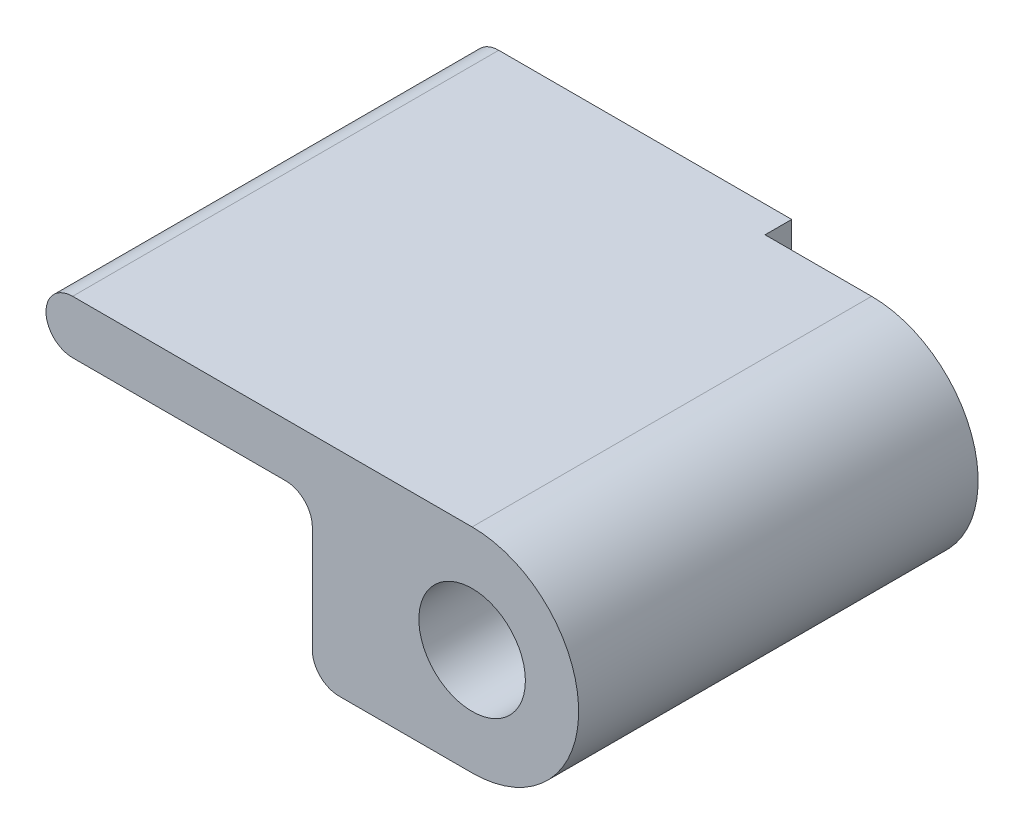
ISO-10303-21;
HEADER;
FILE_DESCRIPTION(('STEP AP214'),'2;1');
FILE_NAME('part.step','',(''),(''),'','','');
FILE_SCHEMA(('AUTOMOTIVE_DESIGN { 1 0 10303 214 1 1 1 1 }'));
ENDSEC;
DATA;
#1=APPLICATION_CONTEXT('core data for automotive mechanical design processes');
#2=APPLICATION_PROTOCOL_DEFINITION('international standard','automotive_design',2000,#1);
#3=PRODUCT_CONTEXT('',#1,'mechanical');
#4=PRODUCT('Part','Part','',(#3));
#5=PRODUCT_RELATED_PRODUCT_CATEGORY('part','',(#4));
#6=PRODUCT_DEFINITION_FORMATION('','',#4);
#7=PRODUCT_DEFINITION_CONTEXT('part definition',#1,'design');
#8=PRODUCT_DEFINITION('design','',#6,#7);
#9=PRODUCT_DEFINITION_SHAPE('','',#8);
#10=(LENGTH_UNIT() NAMED_UNIT(*) SI_UNIT(.MILLI.,.METRE.));
#11=(NAMED_UNIT(*) PLANE_ANGLE_UNIT() SI_UNIT($,.RADIAN.));
#12=(NAMED_UNIT(*) SI_UNIT($,.STERADIAN.) SOLID_ANGLE_UNIT());
#13=UNCERTAINTY_MEASURE_WITH_UNIT(LENGTH_MEASURE(1.E-05),#10,'distance_accuracy_value','');
#14=(GEOMETRIC_REPRESENTATION_CONTEXT(3) GLOBAL_UNCERTAINTY_ASSIGNED_CONTEXT((#13)) GLOBAL_UNIT_ASSIGNED_CONTEXT((#10,
#11,#12)) REPRESENTATION_CONTEXT('',''));
#15=CARTESIAN_POINT('',(0.,0.,0.));
#16=DIRECTION('',(0.,0.,1.));
#17=DIRECTION('',(1.,0.,0.));
#18=AXIS2_PLACEMENT_3D('',#15,#16,#17);
#19=CARTESIAN_POINT('',(0.,-6.35,25.4));
#20=DIRECTION('',(0.,-1.,0.));
#21=DIRECTION('',(0.,0.,-1.));
#22=AXIS2_PLACEMENT_3D('',#19,#20,#21);
#23=PLANE('',#22);
#24=DIRECTION('',(-1.,0.,0.));
#25=VECTOR('',#24,1.);
#26=CARTESIAN_POINT('',(0.,-6.35,25.4));
#27=LINE('',#26,#25);
#28=CARTESIAN_POINT('',(0.,-6.35,25.4));
#29=VERTEX_POINT('',#28);
#30=CARTESIAN_POINT('',(-7.9375,-6.35,25.4));
#31=VERTEX_POINT('',#30);
#32=EDGE_CURVE('E168',#29,#31,#27,.T.);
#33=ORIENTED_EDGE('',*,*,#32,.T.);
#34=DIRECTION('',(0.,0.,-1.));
#35=VECTOR('',#34,1.);
#36=CARTESIAN_POINT('',(-7.9375,-6.35,25.4));
#37=LINE('',#36,#35);
#38=CARTESIAN_POINT('',(-7.9375,-6.35,0.));
#39=VERTEX_POINT('',#38);
#40=EDGE_CURVE('E208',#31,#39,#37,.T.);
#41=ORIENTED_EDGE('',*,*,#40,.T.);
#42=DIRECTION('',(-1.,0.,0.));
#43=VECTOR('',#42,1.);
#44=CARTESIAN_POINT('',(0.,-6.35,0.));
#45=LINE('',#44,#43);
#46=CARTESIAN_POINT('',(-6.35,-6.35,0.));
#47=VERTEX_POINT('',#46);
#48=EDGE_CURVE('E155',#47,#39,#45,.T.);
#49=ORIENTED_EDGE('',*,*,#48,.F.);
#50=DIRECTION('',(0.,0.,-1.));
#51=VECTOR('',#50,1.);
#52=CARTESIAN_POINT('',(-6.35,-6.35,1.5875));
#53=LINE('',#52,#51);
#54=CARTESIAN_POINT('',(-6.35,-6.35,1.5875));
#55=VERTEX_POINT('',#54);
#56=EDGE_CURVE('E144',#55,#47,#53,.T.);
#57=ORIENTED_EDGE('',*,*,#56,.F.);
#58=DIRECTION('',(1.,0.,0.));
#59=VECTOR('',#58,1.);
#60=CARTESIAN_POINT('',(0.,-6.35,1.5875));
#61=LINE('',#60,#59);
#62=CARTESIAN_POINT('',(0.,-6.35,1.5875));
#63=VERTEX_POINT('',#62);
#64=EDGE_CURVE('E128',#55,#63,#61,.T.);
#65=ORIENTED_EDGE('',*,*,#64,.T.);
#66=DIRECTION('',(0.,0.,-1.));
#67=VECTOR('',#66,1.);
#68=CARTESIAN_POINT('',(0.,-6.35,25.4));
#69=LINE('',#68,#67);
#70=EDGE_CURVE('E206',#29,#63,#69,.T.);
#71=ORIENTED_EDGE('',*,*,#70,.F.);
#72=EDGE_LOOP('',(#33,#41,#49,#57,#65,#71));
#73=FACE_BOUND('',#72,.T.);
#74=ADVANCED_FACE('F43',(#73),#23,.T.);
#75=CARTESIAN_POINT('',(0.,6.35,25.4));
#76=DIRECTION('',(0.,1.,0.));
#77=DIRECTION('',(0.,0.,1.));
#78=AXIS2_PLACEMENT_3D('',#75,#76,#77);
#79=PLANE('',#78);
#80=DIRECTION('',(1.,0.,0.));
#81=VECTOR('',#80,1.);
#82=CARTESIAN_POINT('',(0.,6.35,0.));
#83=LINE('',#82,#81);
#84=CARTESIAN_POINT('',(-23.8125,6.35,0.));
#85=VERTEX_POINT('',#84);
#86=CARTESIAN_POINT('',(-6.35,6.35,0.));
#87=VERTEX_POINT('',#86);
#88=EDGE_CURVE('E193',#85,#87,#83,.T.);
#89=ORIENTED_EDGE('',*,*,#88,.F.);
#90=DIRECTION('',(0.,0.,-1.));
#91=VECTOR('',#90,1.);
#92=CARTESIAN_POINT('',(-23.8125,6.35,25.4));
#93=LINE('',#92,#91);
#94=CARTESIAN_POINT('',(-23.8125,6.35,25.4));
#95=VERTEX_POINT('',#94);
#96=EDGE_CURVE('E241',#85,#95,#93,.F.);
#97=ORIENTED_EDGE('',*,*,#96,.T.);
#98=DIRECTION('',(1.,0.,0.));
#99=VECTOR('',#98,1.);
#100=CARTESIAN_POINT('',(0.,6.35,25.4));
#101=LINE('',#100,#99);
#102=CARTESIAN_POINT('',(0.,6.35,25.4));
#103=VERTEX_POINT('',#102);
#104=EDGE_CURVE('E176',#95,#103,#101,.T.);
#105=ORIENTED_EDGE('',*,*,#104,.T.);
#106=DIRECTION('',(0.,0.,-1.));
#107=VECTOR('',#106,1.);
#108=CARTESIAN_POINT('',(0.,6.35,25.4));
#109=LINE('',#108,#107);
#110=CARTESIAN_POINT('',(0.,6.35,1.5875));
#111=VERTEX_POINT('',#110);
#112=EDGE_CURVE('E190',#103,#111,#109,.T.);
#113=ORIENTED_EDGE('',*,*,#112,.T.);
#114=DIRECTION('',(-1.,0.,0.));
#115=VECTOR('',#114,1.);
#116=CARTESIAN_POINT('',(0.,6.35,1.5875));
#117=LINE('',#116,#115);
#118=CARTESIAN_POINT('',(-6.35,6.35,1.5875));
#119=VERTEX_POINT('',#118);
#120=EDGE_CURVE('E139',#111,#119,#117,.T.);
#121=ORIENTED_EDGE('',*,*,#120,.T.);
#122=DIRECTION('',(0.,0.,-1.));
#123=VECTOR('',#122,1.);
#124=CARTESIAN_POINT('',(-6.35,6.35,1.5875));
#125=LINE('',#124,#123);
#126=EDGE_CURVE('E147',#119,#87,#125,.T.);
#127=ORIENTED_EDGE('',*,*,#126,.T.);
#128=EDGE_LOOP('',(#89,#97,#105,#113,#121,#127));
#129=FACE_BOUND('',#128,.T.);
#130=ADVANCED_FACE('F274',(#129),#79,.T.);
#131=CARTESIAN_POINT('',(0.,0.,0.));
#132=DIRECTION('',(0.,0.,1.));
#133=DIRECTION('',(1.,0.,0.));
#134=AXIS2_PLACEMENT_3D('',#131,#132,#133);
#135=PLANE('',#134);
#136=ORIENTED_EDGE('',*,*,#48,.T.);
#137=CARTESIAN_POINT('',(-7.9375,-4.7625,0.));
#138=DIRECTION('',(0.,0.,1.));
#139=DIRECTION('',(1.,0.,0.));
#140=AXIS2_PLACEMENT_3D('',#137,#138,#139);
#141=CIRCLE('',#140,1.5875);
#142=CARTESIAN_POINT('',(-9.525,-4.7625,0.));
#143=VERTEX_POINT('',#142);
#144=EDGE_CURVE('E218',#39,#143,#141,.F.);
#145=ORIENTED_EDGE('',*,*,#144,.T.);
#146=DIRECTION('',(0.,1.,0.));
#147=VECTOR('',#146,1.);
#148=CARTESIAN_POINT('',(-9.525,0.,0.));
#149=LINE('',#148,#147);
#150=CARTESIAN_POINT('',(-9.525,1.5875,0.));
#151=VERTEX_POINT('',#150);
#152=EDGE_CURVE('E172',#143,#151,#149,.T.);
#153=ORIENTED_EDGE('',*,*,#152,.T.);
#154=CARTESIAN_POINT('',(-11.1125,1.5875,0.));
#155=DIRECTION('',(0.,0.,1.));
#156=DIRECTION('',(1.,0.,0.));
#157=AXIS2_PLACEMENT_3D('',#154,#155,#156);
#158=CIRCLE('',#157,1.5875);
#159=CARTESIAN_POINT('',(-11.1125,3.175,0.));
#160=VERTEX_POINT('',#159);
#161=EDGE_CURVE('E53',#151,#160,#158,.T.);
#162=ORIENTED_EDGE('',*,*,#161,.T.);
#163=DIRECTION('',(-1.,0.,0.));
#164=VECTOR('',#163,1.);
#165=CARTESIAN_POINT('',(0.,3.175,0.));
#166=LINE('',#165,#164);
#167=CARTESIAN_POINT('',(-23.8125,3.175,0.));
#168=VERTEX_POINT('',#167);
#169=EDGE_CURVE('E196',#160,#168,#166,.T.);
#170=ORIENTED_EDGE('',*,*,#169,.T.);
#171=CARTESIAN_POINT('',(-23.8125,4.7625,0.));
#172=DIRECTION('',(0.,0.,1.));
#173=DIRECTION('',(1.,0.,0.));
#174=AXIS2_PLACEMENT_3D('',#171,#172,#173);
#175=CIRCLE('',#174,1.5875);
#176=CARTESIAN_POINT('',(-25.4,4.7625,0.));
#177=VERTEX_POINT('',#176);
#178=EDGE_CURVE('E212',#168,#177,#175,.F.);
#179=ORIENTED_EDGE('',*,*,#178,.T.);
#180=CARTESIAN_POINT('',(-23.8125,4.7625,0.));
#181=DIRECTION('',(0.,0.,1.));
#182=DIRECTION('',(1.,0.,0.));
#183=AXIS2_PLACEMENT_3D('',#180,#181,#182);
#184=CIRCLE('',#183,1.5875);
#185=EDGE_CURVE('E215',#177,#85,#184,.F.);
#186=ORIENTED_EDGE('',*,*,#185,.T.);
#187=ORIENTED_EDGE('',*,*,#88,.T.);
#188=DIRECTION('',(0.,-1.,0.));
#189=VECTOR('',#188,1.);
#190=CARTESIAN_POINT('',(-6.35,0.,0.));
#191=LINE('',#190,#189);
#192=EDGE_CURVE('E149',#87,#47,#191,.T.);
#193=ORIENTED_EDGE('',*,*,#192,.T.);
#194=EDGE_LOOP('',(#136,#145,#153,#162,#170,#179,#186,#187,#193));
#195=FACE_BOUND('',#194,.T.);
#196=ADVANCED_FACE('F247',(#195),#135,.F.);
#197=CARTESIAN_POINT('',(0.,0.,25.4));
#198=DIRECTION('',(0.,0.,-1.));
#199=DIRECTION('',(-1.,0.,0.));
#200=AXIS2_PLACEMENT_3D('',#197,#198,#199);
#201=CYLINDRICAL_SURFACE('',#200,6.35);
#202=CARTESIAN_POINT('',(0.,0.,1.5875));
#203=DIRECTION('',(0.,0.,1.));
#204=DIRECTION('',(1.,0.,0.));
#205=AXIS2_PLACEMENT_3D('',#202,#203,#204);
#206=CIRCLE('',#205,6.35);
#207=EDGE_CURVE('E134',#63,#111,#206,.T.);
#208=ORIENTED_EDGE('',*,*,#207,.T.);
#209=ORIENTED_EDGE('',*,*,#112,.F.);
#210=CARTESIAN_POINT('',(0.,0.,25.4));
#211=DIRECTION('',(0.,0.,1.));
#212=DIRECTION('',(1.,0.,0.));
#213=AXIS2_PLACEMENT_3D('',#210,#211,#212);
#214=CIRCLE('',#213,6.35);
#215=EDGE_CURVE('E171',#29,#103,#214,.T.);
#216=ORIENTED_EDGE('',*,*,#215,.F.);
#217=ORIENTED_EDGE('',*,*,#70,.T.);
#218=EDGE_LOOP('',(#208,#209,#216,#217));
#219=FACE_BOUND('',#218,.T.);
#220=ADVANCED_FACE('F270',(#219),#201,.T.);
#221=CARTESIAN_POINT('',(0.,3.175,25.4));
#222=DIRECTION('',(0.,-1.,0.));
#223=DIRECTION('',(1.,0.,0.));
#224=AXIS2_PLACEMENT_3D('',#221,#222,#223);
#225=PLANE('',#224);
#226=ORIENTED_EDGE('',*,*,#169,.F.);
#227=DIRECTION('',(0.,0.,-1.));
#228=VECTOR('',#227,1.);
#229=CARTESIAN_POINT('',(-11.1125,3.175,25.4));
#230=LINE('',#229,#228);
#231=CARTESIAN_POINT('',(-11.1125,3.175,25.4));
#232=VERTEX_POINT('',#231);
#233=EDGE_CURVE('E67',#160,#232,#230,.F.);
#234=ORIENTED_EDGE('',*,*,#233,.T.);
#235=DIRECTION('',(-1.,0.,0.));
#236=VECTOR('',#235,1.);
#237=CARTESIAN_POINT('',(0.,3.175,25.4));
#238=LINE('',#237,#236);
#239=CARTESIAN_POINT('',(-23.8125,3.175,25.4));
#240=VERTEX_POINT('',#239);
#241=EDGE_CURVE('E179',#232,#240,#238,.T.);
#242=ORIENTED_EDGE('',*,*,#241,.T.);
#243=DIRECTION('',(0.,0.,-1.));
#244=VECTOR('',#243,1.);
#245=CARTESIAN_POINT('',(-23.8125,3.175,25.4));
#246=LINE('',#245,#244);
#247=EDGE_CURVE('E236',#240,#168,#246,.T.);
#248=ORIENTED_EDGE('',*,*,#247,.T.);
#249=EDGE_LOOP('',(#226,#234,#242,#248));
#250=FACE_BOUND('',#249,.T.);
#251=ADVANCED_FACE('F252',(#250),#225,.T.);
#252=CARTESIAN_POINT('',(-9.525,0.,25.4));
#253=DIRECTION('',(-1.,0.,0.));
#254=DIRECTION('',(0.,0.,1.));
#255=AXIS2_PLACEMENT_3D('',#252,#253,#254);
#256=PLANE('',#255);
#257=ORIENTED_EDGE('',*,*,#152,.F.);
#258=DIRECTION('',(0.,0.,-1.));
#259=VECTOR('',#258,1.);
#260=CARTESIAN_POINT('',(-9.525,-4.7625,25.4));
#261=LINE('',#260,#259);
#262=CARTESIAN_POINT('',(-9.525,-4.7625,25.4));
#263=VERTEX_POINT('',#262);
#264=EDGE_CURVE('E225',#143,#263,#261,.F.);
#265=ORIENTED_EDGE('',*,*,#264,.T.);
#266=DIRECTION('',(0.,1.,0.));
#267=VECTOR('',#266,1.);
#268=CARTESIAN_POINT('',(-9.525,0.,25.4));
#269=LINE('',#268,#267);
#270=CARTESIAN_POINT('',(-9.525,1.5875,25.4));
#271=VERTEX_POINT('',#270);
#272=EDGE_CURVE('E182',#263,#271,#269,.T.);
#273=ORIENTED_EDGE('',*,*,#272,.T.);
#274=DIRECTION('',(0.,0.,-1.));
#275=VECTOR('',#274,1.);
#276=CARTESIAN_POINT('',(-9.525,1.5875,0.));
#277=LINE('',#276,#275);
#278=EDGE_CURVE('E221',#271,#151,#277,.T.);
#279=ORIENTED_EDGE('',*,*,#278,.T.);
#280=EDGE_LOOP('',(#257,#265,#273,#279));
#281=FACE_BOUND('',#280,.T.);
#282=ADVANCED_FACE('F261',(#281),#256,.T.);
#283=CARTESIAN_POINT('',(0.,0.,25.4));
#284=DIRECTION('',(0.,0.,-1.));
#285=DIRECTION('',(-1.,0.,0.));
#286=AXIS2_PLACEMENT_3D('',#283,#284,#285);
#287=CYLINDRICAL_SURFACE('',#286,3.175);
#288=CARTESIAN_POINT('',(0.,0.,1.5875));
#289=DIRECTION('',(0.,0.,1.));
#290=DIRECTION('',(1.,0.,0.));
#291=AXIS2_PLACEMENT_3D('',#288,#289,#290);
#292=CIRCLE('',#291,3.175);
#293=CARTESIAN_POINT('',(3.175,0.,1.5875));
#294=VERTEX_POINT('',#293);
#295=EDGE_CURVE('E157',#294,#294,#292,.T.);
#296=ORIENTED_EDGE('',*,*,#295,.F.);
#297=EDGE_LOOP('',(#296));
#298=FACE_BOUND('',#297,.T.);
#299=CARTESIAN_POINT('',(0.,0.,25.4));
#300=DIRECTION('',(0.,0.,1.));
#301=DIRECTION('',(1.,0.,0.));
#302=AXIS2_PLACEMENT_3D('',#299,#300,#301);
#303=CIRCLE('',#302,3.175);
#304=CARTESIAN_POINT('',(3.175,0.,25.4));
#305=VERTEX_POINT('',#304);
#306=EDGE_CURVE('E186',#305,#305,#303,.T.);
#307=ORIENTED_EDGE('',*,*,#306,.T.);
#308=EDGE_LOOP('',(#307));
#309=FACE_BOUND('',#308,.T.);
#310=ADVANCED_FACE('F313',(#298,#309),#287,.F.);
#311=CARTESIAN_POINT('',(0.,0.,25.4));
#312=DIRECTION('',(0.,0.,1.));
#313=DIRECTION('',(1.,0.,0.));
#314=AXIS2_PLACEMENT_3D('',#311,#312,#313);
#315=PLANE('',#314);
#316=ORIENTED_EDGE('',*,*,#272,.F.);
#317=CARTESIAN_POINT('',(-7.9375,-4.7625,25.4));
#318=DIRECTION('',(0.,0.,1.));
#319=DIRECTION('',(1.,0.,0.));
#320=AXIS2_PLACEMENT_3D('',#317,#318,#319);
#321=CIRCLE('',#320,1.5875);
#322=EDGE_CURVE('E233',#263,#31,#321,.T.);
#323=ORIENTED_EDGE('',*,*,#322,.T.);
#324=ORIENTED_EDGE('',*,*,#32,.F.);
#325=ORIENTED_EDGE('',*,*,#215,.T.);
#326=ORIENTED_EDGE('',*,*,#104,.F.);
#327=CARTESIAN_POINT('',(-23.8125,4.7625,25.4));
#328=DIRECTION('',(0.,0.,1.));
#329=DIRECTION('',(1.,0.,0.));
#330=AXIS2_PLACEMENT_3D('',#327,#328,#329);
#331=CIRCLE('',#330,1.5875);
#332=CARTESIAN_POINT('',(-25.4,4.7625,25.4));
#333=VERTEX_POINT('',#332);
#334=EDGE_CURVE('E230',#95,#333,#331,.T.);
#335=ORIENTED_EDGE('',*,*,#334,.T.);
#336=CARTESIAN_POINT('',(-23.8125,4.7625,25.4));
#337=DIRECTION('',(0.,0.,1.));
#338=DIRECTION('',(1.,0.,0.));
#339=AXIS2_PLACEMENT_3D('',#336,#337,#338);
#340=CIRCLE('',#339,1.5875);
#341=EDGE_CURVE('E60',#333,#240,#340,.T.);
#342=ORIENTED_EDGE('',*,*,#341,.T.);
#343=ORIENTED_EDGE('',*,*,#241,.F.);
#344=CARTESIAN_POINT('',(-11.1125,1.5875,25.4));
#345=DIRECTION('',(0.,0.,1.));
#346=DIRECTION('',(1.,0.,0.));
#347=AXIS2_PLACEMENT_3D('',#344,#345,#346);
#348=CIRCLE('',#347,1.5875);
#349=EDGE_CURVE('E11',#232,#271,#348,.F.);
#350=ORIENTED_EDGE('',*,*,#349,.T.);
#351=EDGE_LOOP('',(#316,#323,#324,#325,#326,#335,#342,#343,#350));
#352=FACE_BOUND('',#351,.T.);
#353=ORIENTED_EDGE('',*,*,#306,.F.);
#354=EDGE_LOOP('',(#353));
#355=FACE_BOUND('',#354,.T.);
#356=ADVANCED_FACE('F257',(#352,#355),#315,.T.);
#357=CARTESIAN_POINT('',(0.,0.,1.5875));
#358=DIRECTION('',(0.,0.,1.));
#359=DIRECTION('',(1.,0.,0.));
#360=AXIS2_PLACEMENT_3D('',#357,#358,#359);
#361=PLANE('',#360);
#362=ORIENTED_EDGE('',*,*,#295,.T.);
#363=EDGE_LOOP('',(#362));
#364=FACE_BOUND('',#363,.T.);
#365=ORIENTED_EDGE('',*,*,#207,.F.);
#366=ORIENTED_EDGE('',*,*,#64,.F.);
#367=DIRECTION('',(0.,-1.,0.));
#368=VECTOR('',#367,1.);
#369=CARTESIAN_POINT('',(-6.35,0.,1.5875));
#370=LINE('',#369,#368);
#371=EDGE_CURVE('E132',#119,#55,#370,.T.);
#372=ORIENTED_EDGE('',*,*,#371,.F.);
#373=ORIENTED_EDGE('',*,*,#120,.F.);
#374=EDGE_LOOP('',(#365,#366,#372,#373));
#375=FACE_BOUND('',#374,.T.);
#376=ADVANCED_FACE('F130',(#364,#375),#361,.F.);
#377=CARTESIAN_POINT('',(-6.35,0.,1.5875));
#378=DIRECTION('',(1.,0.,0.));
#379=DIRECTION('',(0.,0.,-1.));
#380=AXIS2_PLACEMENT_3D('',#377,#378,#379);
#381=PLANE('',#380);
#382=ORIENTED_EDGE('',*,*,#192,.F.);
#383=ORIENTED_EDGE('',*,*,#126,.F.);
#384=ORIENTED_EDGE('',*,*,#371,.T.);
#385=ORIENTED_EDGE('',*,*,#56,.T.);
#386=EDGE_LOOP('',(#382,#383,#384,#385));
#387=FACE_BOUND('',#386,.T.);
#388=ADVANCED_FACE('F143',(#387),#381,.T.);
#389=CARTESIAN_POINT('',(-7.9375,-4.7625,25.4));
#390=DIRECTION('',(0.,0.,-1.));
#391=DIRECTION('',(-1.,0.,0.));
#392=AXIS2_PLACEMENT_3D('',#389,#390,#391);
#393=CYLINDRICAL_SURFACE('',#392,1.5875);
#394=ORIENTED_EDGE('',*,*,#322,.F.);
#395=ORIENTED_EDGE('',*,*,#264,.F.);
#396=ORIENTED_EDGE('',*,*,#144,.F.);
#397=ORIENTED_EDGE('',*,*,#40,.F.);
#398=EDGE_LOOP('',(#394,#395,#396,#397));
#399=FACE_BOUND('',#398,.T.);
#400=ADVANCED_FACE('F264',(#399),#393,.T.);
#401=CARTESIAN_POINT('',(-11.1125,1.5875,25.4));
#402=DIRECTION('',(0.,0.,1.));
#403=DIRECTION('',(1.,0.,0.));
#404=AXIS2_PLACEMENT_3D('',#401,#402,#403);
#405=CYLINDRICAL_SURFACE('',#404,1.5875);
#406=ORIENTED_EDGE('',*,*,#349,.F.);
#407=ORIENTED_EDGE('',*,*,#233,.F.);
#408=ORIENTED_EDGE('',*,*,#161,.F.);
#409=ORIENTED_EDGE('',*,*,#278,.F.);
#410=EDGE_LOOP('',(#406,#407,#408,#409));
#411=FACE_BOUND('',#410,.T.);
#412=ADVANCED_FACE('F255',(#411),#405,.F.);
#413=CARTESIAN_POINT('',(-23.8125,4.7625,25.4));
#414=DIRECTION('',(0.,0.,-1.));
#415=DIRECTION('',(-1.,0.,0.));
#416=AXIS2_PLACEMENT_3D('',#413,#414,#415);
#417=CYLINDRICAL_SURFACE('',#416,1.5875);
#418=ORIENTED_EDGE('',*,*,#247,.F.);
#419=ORIENTED_EDGE('',*,*,#341,.F.);
#420=DIRECTION('',(0.,0.,-1.));
#421=VECTOR('',#420,1.);
#422=CARTESIAN_POINT('',(-25.4,4.7625,25.4));
#423=LINE('',#422,#421);
#424=EDGE_CURVE('E47',#177,#333,#423,.F.);
#425=ORIENTED_EDGE('',*,*,#424,.F.);
#426=ORIENTED_EDGE('',*,*,#178,.F.);
#427=EDGE_LOOP('',(#418,#419,#425,#426));
#428=FACE_BOUND('',#427,.T.);
#429=ADVANCED_FACE('F45',(#428),#417,.T.);
#430=CARTESIAN_POINT('',(-23.8125,4.7625,25.4));
#431=DIRECTION('',(0.,0.,-1.));
#432=DIRECTION('',(-1.,0.,0.));
#433=AXIS2_PLACEMENT_3D('',#430,#431,#432);
#434=CYLINDRICAL_SURFACE('',#433,1.5875);
#435=ORIENTED_EDGE('',*,*,#334,.F.);
#436=ORIENTED_EDGE('',*,*,#96,.F.);
#437=ORIENTED_EDGE('',*,*,#185,.F.);
#438=ORIENTED_EDGE('',*,*,#424,.T.);
#439=EDGE_LOOP('',(#435,#436,#437,#438));
#440=FACE_BOUND('',#439,.T.);
#441=ADVANCED_FACE('F278',(#440),#434,.T.);
#442=CLOSED_SHELL('',(#74,#130,#196,#220,#251,#282,#310,#356,#376,#388,#400,#412,#429,#441));
#443=MANIFOLD_SOLID_BREP('B2',#442);
#444=ADVANCED_BREP_SHAPE_REPRESENTATION('',(#18,#443),#14);
#445=SHAPE_DEFINITION_REPRESENTATION(#9,#444);
ENDSEC;
END-ISO-10303-21;
